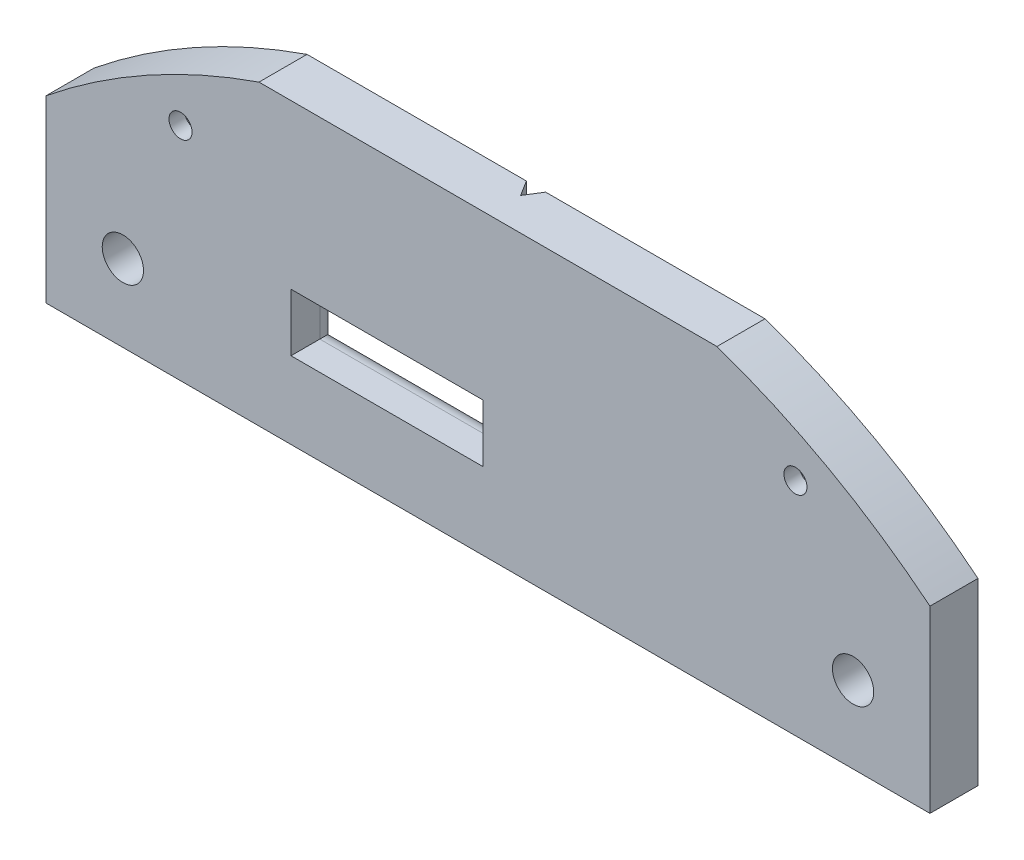
ISO-10303-21;
HEADER;
FILE_DESCRIPTION(('STEP AP214'),'2;1');
FILE_NAME('part.step','',(''),(''),'','','');
FILE_SCHEMA(('AUTOMOTIVE_DESIGN { 1 0 10303 214 1 1 1 1 }'));
ENDSEC;
DATA;
#1=APPLICATION_CONTEXT('core data for automotive mechanical design processes');
#2=APPLICATION_PROTOCOL_DEFINITION('international standard','automotive_design',2000,#1);
#3=PRODUCT_CONTEXT('',#1,'mechanical');
#4=PRODUCT('Part','Part','',(#3));
#5=PRODUCT_RELATED_PRODUCT_CATEGORY('part','',(#4));
#6=PRODUCT_DEFINITION_FORMATION('','',#4);
#7=PRODUCT_DEFINITION_CONTEXT('part definition',#1,'design');
#8=PRODUCT_DEFINITION('design','',#6,#7);
#9=PRODUCT_DEFINITION_SHAPE('','',#8);
#10=(LENGTH_UNIT() NAMED_UNIT(*) SI_UNIT(.MILLI.,.METRE.));
#11=(NAMED_UNIT(*) PLANE_ANGLE_UNIT() SI_UNIT($,.RADIAN.));
#12=(NAMED_UNIT(*) SI_UNIT($,.STERADIAN.) SOLID_ANGLE_UNIT());
#13=UNCERTAINTY_MEASURE_WITH_UNIT(LENGTH_MEASURE(1.E-05),#10,'distance_accuracy_value','');
#14=(GEOMETRIC_REPRESENTATION_CONTEXT(3) GLOBAL_UNCERTAINTY_ASSIGNED_CONTEXT((#13)) GLOBAL_UNIT_ASSIGNED_CONTEXT((#10,
#11,#12)) REPRESENTATION_CONTEXT('',''));
#15=CARTESIAN_POINT('',(0.,0.,0.));
#16=DIRECTION('',(0.,0.,1.));
#17=DIRECTION('',(1.,0.,0.));
#18=AXIS2_PLACEMENT_3D('',#15,#16,#17);
#19=CARTESIAN_POINT('',(32.,7.50000000000001,0.));
#20=DIRECTION('',(0.,0.,1.));
#21=DIRECTION('',(1.,0.,0.));
#22=AXIS2_PLACEMENT_3D('',#19,#20,#21);
#23=CYLINDRICAL_SURFACE('',#22,1.2);
#24=CARTESIAN_POINT('',(32.,7.50000000000001,5.));
#25=DIRECTION('',(0.,0.,1.));
#26=DIRECTION('',(1.,0.,0.));
#27=AXIS2_PLACEMENT_3D('',#24,#25,#26);
#28=CIRCLE('',#27,1.2);
#29=CARTESIAN_POINT('',(33.2,7.50000000000001,5.));
#30=VERTEX_POINT('',#29);
#31=EDGE_CURVE('E204',#30,#30,#28,.T.);
#32=ORIENTED_EDGE('',*,*,#31,.T.);
#33=EDGE_LOOP('',(#32));
#34=FACE_BOUND('',#33,.T.);
#35=CARTESIAN_POINT('',(32.,7.50000000000001,3.4));
#36=DIRECTION('',(0.,0.,-1.));
#37=DIRECTION('',(-1.,0.,0.));
#38=AXIS2_PLACEMENT_3D('',#35,#36,#37);
#39=CIRCLE('',#38,1.2);
#40=CARTESIAN_POINT('',(30.8,7.50000000000001,3.4));
#41=VERTEX_POINT('',#40);
#42=EDGE_CURVE('E201',#41,#41,#39,.F.);
#43=ORIENTED_EDGE('',*,*,#42,.F.);
#44=EDGE_LOOP('',(#43));
#45=FACE_BOUND('',#44,.T.);
#46=ADVANCED_FACE('F39',(#34,#45),#23,.F.);
#47=CARTESIAN_POINT('',(-32.,7.50000000000001,0.));
#48=DIRECTION('',(0.,0.,1.));
#49=DIRECTION('',(1.,0.,0.));
#50=AXIS2_PLACEMENT_3D('',#47,#48,#49);
#51=CYLINDRICAL_SURFACE('',#50,1.2);
#52=CARTESIAN_POINT('',(-32.,7.50000000000001,5.));
#53=DIRECTION('',(0.,0.,1.));
#54=DIRECTION('',(1.,0.,0.));
#55=AXIS2_PLACEMENT_3D('',#52,#53,#54);
#56=CIRCLE('',#55,1.2);
#57=CARTESIAN_POINT('',(-30.8,7.50000000000001,5.));
#58=VERTEX_POINT('',#57);
#59=EDGE_CURVE('E197',#58,#58,#56,.T.);
#60=ORIENTED_EDGE('',*,*,#59,.T.);
#61=EDGE_LOOP('',(#60));
#62=FACE_BOUND('',#61,.T.);
#63=CARTESIAN_POINT('',(-32.,7.50000000000001,3.4));
#64=DIRECTION('',(0.,0.,-1.));
#65=DIRECTION('',(-1.,0.,0.));
#66=AXIS2_PLACEMENT_3D('',#63,#64,#65);
#67=CIRCLE('',#66,1.2);
#68=CARTESIAN_POINT('',(-33.2,7.50000000000001,3.4));
#69=VERTEX_POINT('',#68);
#70=EDGE_CURVE('E186',#69,#69,#67,.F.);
#71=ORIENTED_EDGE('',*,*,#70,.F.);
#72=EDGE_LOOP('',(#71));
#73=FACE_BOUND('',#72,.T.);
#74=ADVANCED_FACE('F382',(#62,#73),#51,.F.);
#75=CARTESIAN_POINT('',(0.,0.,0.));
#76=DIRECTION('',(0.,0.,1.));
#77=DIRECTION('',(1.,0.,0.));
#78=AXIS2_PLACEMENT_3D('',#75,#76,#77);
#79=PLANE('',#78);
#80=CARTESIAN_POINT('',(-32.,7.50000000000001,0.));
#81=DIRECTION('',(0.,0.,-1.));
#82=DIRECTION('',(-1.,0.,0.));
#83=AXIS2_PLACEMENT_3D('',#80,#81,#82);
#84=CIRCLE('',#83,2.1);
#85=CARTESIAN_POINT('',(-34.1,7.50000000000001,0.));
#86=VERTEX_POINT('',#85);
#87=EDGE_CURVE('E188',#86,#86,#84,.T.);
#88=ORIENTED_EDGE('',*,*,#87,.F.);
#89=EDGE_LOOP('',(#88));
#90=FACE_BOUND('',#89,.T.);
#91=CARTESIAN_POINT('',(-38.,-7.49999999999999,0.));
#92=DIRECTION('',(0.,0.,1.));
#93=DIRECTION('',(-1.,0.,0.));
#94=AXIS2_PLACEMENT_3D('',#91,#92,#93);
#95=CIRCLE('',#94,2.15);
#96=CARTESIAN_POINT('',(-40.15,-7.49999999999999,0.));
#97=VERTEX_POINT('',#96);
#98=EDGE_CURVE('E223',#97,#97,#95,.T.);
#99=ORIENTED_EDGE('',*,*,#98,.T.);
#100=EDGE_LOOP('',(#99));
#101=FACE_BOUND('',#100,.T.);
#102=DIRECTION('',(0.,1.,0.));
#103=VECTOR('',#102,1.);
#104=CARTESIAN_POINT('',(-22.5,0.,0.));
#105=LINE('',#104,#103);
#106=CARTESIAN_POINT('',(-22.5,0.500000000000006,0.));
#107=VERTEX_POINT('',#106);
#108=CARTESIAN_POINT('',(-22.5,-9.49999999999999,0.));
#109=VERTEX_POINT('',#108);
#110=EDGE_CURVE('E295',#107,#109,#105,.F.);
#111=ORIENTED_EDGE('',*,*,#110,.T.);
#112=DIRECTION('',(-1.,0.,0.));
#113=VECTOR('',#112,1.);
#114=CARTESIAN_POINT('',(0.,-9.49999999999999,0.));
#115=LINE('',#114,#113);
#116=CARTESIAN_POINT('',(-1.,-9.5,0.));
#117=VERTEX_POINT('',#116);
#118=EDGE_CURVE('E298',#109,#117,#115,.F.);
#119=ORIENTED_EDGE('',*,*,#118,.T.);
#120=DIRECTION('',(0.,-1.,0.));
#121=VECTOR('',#120,1.);
#122=CARTESIAN_POINT('',(-1.,15.5,0.));
#123=LINE('',#122,#121);
#124=CARTESIAN_POINT('',(-1.,-15.5,0.));
#125=VERTEX_POINT('',#124);
#126=EDGE_CURVE('E224',#117,#125,#123,.T.);
#127=ORIENTED_EDGE('',*,*,#126,.T.);
#128=DIRECTION('',(1.,0.,0.));
#129=VECTOR('',#128,1.);
#130=CARTESIAN_POINT('',(-46.,-15.5,0.));
#131=LINE('',#130,#129);
#132=CARTESIAN_POINT('',(-46.,-15.5,0.));
#133=VERTEX_POINT('',#132);
#134=EDGE_CURVE('E256',#133,#125,#131,.T.);
#135=ORIENTED_EDGE('',*,*,#134,.F.);
#136=DIRECTION('',(0.,-1.,0.));
#137=VECTOR('',#136,1.);
#138=CARTESIAN_POINT('',(-46.,15.5,0.));
#139=LINE('',#138,#137);
#140=CARTESIAN_POINT('',(-46.,3.18333088307355,0.));
#141=VERTEX_POINT('',#140);
#142=EDGE_CURVE('E272',#141,#133,#139,.T.);
#143=ORIENTED_EDGE('',*,*,#142,.F.);
#144=CARTESIAN_POINT('',(0.,-53.5,0.));
#145=DIRECTION('',(0.,0.,1.));
#146=DIRECTION('',(1.,0.,0.));
#147=AXIS2_PLACEMENT_3D('',#144,#145,#146);
#148=CIRCLE('',#147,73.);
#149=CARTESIAN_POINT('',(-23.832750575626,15.5,0.));
#150=VERTEX_POINT('',#149);
#151=EDGE_CURVE('E283',#150,#141,#148,.T.);
#152=ORIENTED_EDGE('',*,*,#151,.F.);
#153=DIRECTION('',(-1.,0.,0.));
#154=VECTOR('',#153,1.);
#155=CARTESIAN_POINT('',(-46.,15.5,0.));
#156=LINE('',#155,#154);
#157=CARTESIAN_POINT('',(-1.,15.5,0.));
#158=VERTEX_POINT('',#157);
#159=EDGE_CURVE('E269',#158,#150,#156,.T.);
#160=ORIENTED_EDGE('',*,*,#159,.F.);
#161=CARTESIAN_POINT('',(-1.,0.500000000000006,0.));
#162=VERTEX_POINT('',#161);
#163=EDGE_CURVE('E217',#158,#162,#123,.T.);
#164=ORIENTED_EDGE('',*,*,#163,.T.);
#165=DIRECTION('',(1.,0.,0.));
#166=VECTOR('',#165,1.);
#167=CARTESIAN_POINT('',(0.,0.500000000000006,0.));
#168=LINE('',#167,#166);
#169=EDGE_CURVE('E292',#162,#107,#168,.F.);
#170=ORIENTED_EDGE('',*,*,#169,.T.);
#171=EDGE_LOOP('',(#111,#119,#127,#135,#143,#152,#160,#164,#170));
#172=FACE_BOUND('',#171,.T.);
#173=ADVANCED_FACE('F328',(#90,#101,#172),#79,.F.);
#174=CARTESIAN_POINT('',(46.,15.5,5.));
#175=DIRECTION('',(-1.,0.,0.));
#176=DIRECTION('',(0.,0.,1.));
#177=AXIS2_PLACEMENT_3D('',#174,#175,#176);
#178=PLANE('',#177);
#179=DIRECTION('',(0.,0.,1.));
#180=VECTOR('',#179,1.);
#181=CARTESIAN_POINT('',(46.,3.18333088307357,0.));
#182=LINE('',#181,#180);
#183=CARTESIAN_POINT('',(46.,3.18333088307357,5.));
#184=VERTEX_POINT('',#183);
#185=CARTESIAN_POINT('',(46.,3.18333088307357,0.));
#186=VERTEX_POINT('',#185);
#187=EDGE_CURVE('E249',#184,#186,#182,.F.);
#188=ORIENTED_EDGE('',*,*,#187,.F.);
#189=DIRECTION('',(0.,1.,0.));
#190=VECTOR('',#189,1.);
#191=CARTESIAN_POINT('',(46.,15.5,5.));
#192=LINE('',#191,#190);
#193=CARTESIAN_POINT('',(46.,-15.5,5.));
#194=VERTEX_POINT('',#193);
#195=EDGE_CURVE('E254',#194,#184,#192,.T.);
#196=ORIENTED_EDGE('',*,*,#195,.F.);
#197=DIRECTION('',(0.,0.,-1.));
#198=VECTOR('',#197,1.);
#199=CARTESIAN_POINT('',(46.,-15.5,5.));
#200=LINE('',#199,#198);
#201=CARTESIAN_POINT('',(46.,-15.5,0.));
#202=VERTEX_POINT('',#201);
#203=EDGE_CURVE('E265',#194,#202,#200,.T.);
#204=ORIENTED_EDGE('',*,*,#203,.T.);
#205=DIRECTION('',(0.,1.,0.));
#206=VECTOR('',#205,1.);
#207=CARTESIAN_POINT('',(46.,15.5,0.));
#208=LINE('',#207,#206);
#209=EDGE_CURVE('E255',#202,#186,#208,.T.);
#210=ORIENTED_EDGE('',*,*,#209,.T.);
#211=EDGE_LOOP('',(#188,#196,#204,#210));
#212=FACE_BOUND('',#211,.T.);
#213=ADVANCED_FACE('F370',(#212),#178,.F.);
#214=CARTESIAN_POINT('',(-46.,15.5,5.));
#215=DIRECTION('',(0.,-1.,0.));
#216=DIRECTION('',(0.,0.,-1.));
#217=AXIS2_PLACEMENT_3D('',#214,#215,#216);
#218=PLANE('',#217);
#219=DIRECTION('',(-0.52999894000318,0.,0.847998304005088));
#220=VECTOR('',#219,1.);
#221=CARTESIAN_POINT('',(0.,15.5,1.6));
#222=LINE('',#221,#220);
#223=CARTESIAN_POINT('',(1.,15.5,0.));
#224=VERTEX_POINT('',#223);
#225=CARTESIAN_POINT('',(0.,15.5,1.6));
#226=VERTEX_POINT('',#225);
#227=EDGE_CURVE('E207',#224,#226,#222,.T.);
#228=ORIENTED_EDGE('',*,*,#227,.T.);
#229=DIRECTION('',(-0.52999894000318,0.,-0.847998304005088));
#230=VECTOR('',#229,1.);
#231=CARTESIAN_POINT('',(-1.,15.5,0.));
#232=LINE('',#231,#230);
#233=EDGE_CURVE('E209',#226,#158,#232,.T.);
#234=ORIENTED_EDGE('',*,*,#233,.T.);
#235=ORIENTED_EDGE('',*,*,#159,.T.);
#236=DIRECTION('',(0.,0.,1.));
#237=VECTOR('',#236,1.);
#238=CARTESIAN_POINT('',(-23.832750575626,15.5,0.));
#239=LINE('',#238,#237);
#240=CARTESIAN_POINT('',(-23.832750575626,15.5,5.));
#241=VERTEX_POINT('',#240);
#242=EDGE_CURVE('E244',#241,#150,#239,.F.);
#243=ORIENTED_EDGE('',*,*,#242,.F.);
#244=DIRECTION('',(-1.,0.,0.));
#245=VECTOR('',#244,1.);
#246=CARTESIAN_POINT('',(-46.,15.5,5.));
#247=LINE('',#246,#245);
#248=CARTESIAN_POINT('',(23.832750575626,15.5,5.));
#249=VERTEX_POINT('',#248);
#250=EDGE_CURVE('E259',#249,#241,#247,.T.);
#251=ORIENTED_EDGE('',*,*,#250,.F.);
#252=DIRECTION('',(0.,0.,1.));
#253=VECTOR('',#252,1.);
#254=CARTESIAN_POINT('',(23.832750575626,15.5,0.));
#255=LINE('',#254,#253);
#256=CARTESIAN_POINT('',(23.832750575626,15.5,0.));
#257=VERTEX_POINT('',#256);
#258=EDGE_CURVE('E247',#257,#249,#255,.T.);
#259=ORIENTED_EDGE('',*,*,#258,.F.);
#260=EDGE_CURVE('E267',#257,#224,#156,.T.);
#261=ORIENTED_EDGE('',*,*,#260,.T.);
#262=EDGE_LOOP('',(#228,#234,#235,#243,#251,#259,#261));
#263=FACE_BOUND('',#262,.T.);
#264=ADVANCED_FACE('F331',(#263),#218,.F.);
#265=CARTESIAN_POINT('',(-46.,15.5,5.));
#266=DIRECTION('',(1.,0.,0.));
#267=DIRECTION('',(0.,0.,-1.));
#268=AXIS2_PLACEMENT_3D('',#265,#266,#267);
#269=PLANE('',#268);
#270=DIRECTION('',(0.,0.,1.));
#271=VECTOR('',#270,1.);
#272=CARTESIAN_POINT('',(-46.,3.18333088307355,0.));
#273=LINE('',#272,#271);
#274=CARTESIAN_POINT('',(-46.,3.18333088307355,5.));
#275=VERTEX_POINT('',#274);
#276=EDGE_CURVE('E239',#141,#275,#273,.T.);
#277=ORIENTED_EDGE('',*,*,#276,.F.);
#278=ORIENTED_EDGE('',*,*,#142,.T.);
#279=DIRECTION('',(0.,0.,-1.));
#280=VECTOR('',#279,1.);
#281=CARTESIAN_POINT('',(-46.,-15.5,5.));
#282=LINE('',#281,#280);
#283=CARTESIAN_POINT('',(-46.,-15.5,5.));
#284=VERTEX_POINT('',#283);
#285=EDGE_CURVE('E280',#284,#133,#282,.T.);
#286=ORIENTED_EDGE('',*,*,#285,.F.);
#287=DIRECTION('',(0.,-1.,0.));
#288=VECTOR('',#287,1.);
#289=CARTESIAN_POINT('',(-46.,15.5,5.));
#290=LINE('',#289,#288);
#291=EDGE_CURVE('E257',#275,#284,#290,.T.);
#292=ORIENTED_EDGE('',*,*,#291,.F.);
#293=EDGE_LOOP('',(#277,#278,#286,#292));
#294=FACE_BOUND('',#293,.T.);
#295=ADVANCED_FACE('F343',(#294),#269,.F.);
#296=CARTESIAN_POINT('',(0.,0.,5.));
#297=DIRECTION('',(0.,0.,1.));
#298=DIRECTION('',(1.,0.,0.));
#299=AXIS2_PLACEMENT_3D('',#296,#297,#298);
#300=PLANE('',#299);
#301=DIRECTION('',(0.,1.,0.));
#302=VECTOR('',#301,1.);
#303=CARTESIAN_POINT('',(-20.5,-1.49999999999999,5.));
#304=LINE('',#303,#302);
#305=CARTESIAN_POINT('',(-20.5,-7.49999999999999,5.));
#306=VERTEX_POINT('',#305);
#307=CARTESIAN_POINT('',(-20.5,-1.49999999999999,5.));
#308=VERTEX_POINT('',#307);
#309=EDGE_CURVE('E157',#306,#308,#304,.T.);
#310=ORIENTED_EDGE('',*,*,#309,.T.);
#311=DIRECTION('',(1.,0.,0.));
#312=VECTOR('',#311,1.);
#313=CARTESIAN_POINT('',(-0.500000000000019,-1.49999999999999,5.));
#314=LINE('',#313,#312);
#315=CARTESIAN_POINT('',(-0.500000000000019,-1.49999999999999,5.));
#316=VERTEX_POINT('',#315);
#317=EDGE_CURVE('E165',#308,#316,#314,.T.);
#318=ORIENTED_EDGE('',*,*,#317,.T.);
#319=DIRECTION('',(0.,-1.,0.));
#320=VECTOR('',#319,1.);
#321=CARTESIAN_POINT('',(-0.500000000000019,-1.49999999999999,5.));
#322=LINE('',#321,#320);
#323=CARTESIAN_POINT('',(-0.50000000000002,-7.49999999999999,5.));
#324=VERTEX_POINT('',#323);
#325=EDGE_CURVE('E166',#316,#324,#322,.T.);
#326=ORIENTED_EDGE('',*,*,#325,.T.);
#327=DIRECTION('',(-1.,0.,0.));
#328=VECTOR('',#327,1.);
#329=CARTESIAN_POINT('',(-0.50000000000002,-7.49999999999999,5.));
#330=LINE('',#329,#328);
#331=EDGE_CURVE('E163',#324,#306,#330,.T.);
#332=ORIENTED_EDGE('',*,*,#331,.T.);
#333=EDGE_LOOP('',(#310,#318,#326,#332));
#334=FACE_BOUND('',#333,.T.);
#335=ORIENTED_EDGE('',*,*,#59,.F.);
#336=EDGE_LOOP('',(#335));
#337=FACE_BOUND('',#336,.T.);
#338=ORIENTED_EDGE('',*,*,#31,.F.);
#339=EDGE_LOOP('',(#338));
#340=FACE_BOUND('',#339,.T.);
#341=CARTESIAN_POINT('',(38.,-7.49999999999999,5.));
#342=DIRECTION('',(0.,0.,1.));
#343=DIRECTION('',(1.,0.,0.));
#344=AXIS2_PLACEMENT_3D('',#341,#342,#343);
#345=CIRCLE('',#344,2.15);
#346=CARTESIAN_POINT('',(40.15,-7.49999999999999,5.));
#347=VERTEX_POINT('',#346);
#348=EDGE_CURVE('E229',#347,#347,#345,.T.);
#349=ORIENTED_EDGE('',*,*,#348,.F.);
#350=EDGE_LOOP('',(#349));
#351=FACE_BOUND('',#350,.T.);
#352=CARTESIAN_POINT('',(-38.,-7.49999999999999,5.));
#353=DIRECTION('',(0.,0.,1.));
#354=DIRECTION('',(-1.,0.,0.));
#355=AXIS2_PLACEMENT_3D('',#352,#353,#354);
#356=CIRCLE('',#355,2.15);
#357=CARTESIAN_POINT('',(-40.15,-7.49999999999999,5.));
#358=VERTEX_POINT('',#357);
#359=EDGE_CURVE('E231',#358,#358,#356,.T.);
#360=ORIENTED_EDGE('',*,*,#359,.F.);
#361=EDGE_LOOP('',(#360));
#362=FACE_BOUND('',#361,.T.);
#363=ORIENTED_EDGE('',*,*,#195,.T.);
#364=CARTESIAN_POINT('',(0.,-53.5,5.));
#365=DIRECTION('',(0.,0.,1.));
#366=DIRECTION('',(1.,0.,0.));
#367=AXIS2_PLACEMENT_3D('',#364,#365,#366);
#368=CIRCLE('',#367,73.);
#369=EDGE_CURVE('E241',#184,#249,#368,.T.);
#370=ORIENTED_EDGE('',*,*,#369,.T.);
#371=ORIENTED_EDGE('',*,*,#250,.T.);
#372=EDGE_CURVE('E230',#241,#275,#368,.T.);
#373=ORIENTED_EDGE('',*,*,#372,.T.);
#374=ORIENTED_EDGE('',*,*,#291,.T.);
#375=DIRECTION('',(1.,0.,0.));
#376=VECTOR('',#375,1.);
#377=CARTESIAN_POINT('',(-46.,-15.5,5.));
#378=LINE('',#377,#376);
#379=EDGE_CURVE('E264',#284,#194,#378,.T.);
#380=ORIENTED_EDGE('',*,*,#379,.T.);
#381=EDGE_LOOP('',(#363,#370,#371,#373,#374,#380));
#382=FACE_BOUND('',#381,.T.);
#383=ADVANCED_FACE('F167',(#334,#337,#340,#351,#362,#382),#300,.T.);
#384=CARTESIAN_POINT('',(32.,7.50000000000001,0.));
#385=DIRECTION('',(0.,0.,-1.));
#386=DIRECTION('',(-1.,0.,0.));
#387=AXIS2_PLACEMENT_3D('',#384,#385,#386);
#388=CIRCLE('',#387,2.1);
#389=CARTESIAN_POINT('',(29.9,7.50000000000001,0.));
#390=VERTEX_POINT('',#389);
#391=EDGE_CURVE('E195',#390,#390,#388,.T.);
#392=ORIENTED_EDGE('',*,*,#391,.F.);
#393=EDGE_LOOP('',(#392));
#394=FACE_BOUND('',#393,.T.);
#395=CARTESIAN_POINT('',(38.,-7.49999999999999,0.));
#396=DIRECTION('',(0.,0.,1.));
#397=DIRECTION('',(1.,0.,0.));
#398=AXIS2_PLACEMENT_3D('',#395,#396,#397);
#399=CIRCLE('',#398,2.15);
#400=CARTESIAN_POINT('',(40.15,-7.49999999999999,0.));
#401=VERTEX_POINT('',#400);
#402=EDGE_CURVE('E228',#401,#401,#399,.T.);
#403=ORIENTED_EDGE('',*,*,#402,.T.);
#404=EDGE_LOOP('',(#403));
#405=FACE_BOUND('',#404,.T.);
#406=CARTESIAN_POINT('',(1.,-15.5,0.));
#407=VERTEX_POINT('',#406);
#408=EDGE_CURVE('E271',#407,#202,#131,.T.);
#409=ORIENTED_EDGE('',*,*,#408,.F.);
#410=DIRECTION('',(0.,-1.,0.));
#411=VECTOR('',#410,1.);
#412=CARTESIAN_POINT('',(1.,15.5,0.));
#413=LINE('',#412,#411);
#414=EDGE_CURVE('E215',#224,#407,#413,.T.);
#415=ORIENTED_EDGE('',*,*,#414,.F.);
#416=ORIENTED_EDGE('',*,*,#260,.F.);
#417=CARTESIAN_POINT('',(0.,-53.5,0.));
#418=DIRECTION('',(0.,0.,1.));
#419=DIRECTION('',(1.,0.,0.));
#420=AXIS2_PLACEMENT_3D('',#417,#418,#419);
#421=CIRCLE('',#420,73.);
#422=EDGE_CURVE('E238',#186,#257,#421,.T.);
#423=ORIENTED_EDGE('',*,*,#422,.F.);
#424=ORIENTED_EDGE('',*,*,#209,.F.);
#425=EDGE_LOOP('',(#409,#415,#416,#423,#424));
#426=FACE_BOUND('',#425,.T.);
#427=ADVANCED_FACE('F357',(#394,#405,#426),#79,.F.);
#428=CARTESIAN_POINT('',(-46.,-15.5,5.));
#429=DIRECTION('',(0.,1.,0.));
#430=DIRECTION('',(0.,0.,1.));
#431=AXIS2_PLACEMENT_3D('',#428,#429,#430);
#432=PLANE('',#431);
#433=ORIENTED_EDGE('',*,*,#134,.T.);
#434=DIRECTION('',(-0.52999894000318,0.,-0.847998304005088));
#435=VECTOR('',#434,1.);
#436=CARTESIAN_POINT('',(-1.,-15.5,0.));
#437=LINE('',#436,#435);
#438=CARTESIAN_POINT('',(0.,-15.5,1.6));
#439=VERTEX_POINT('',#438);
#440=EDGE_CURVE('E208',#439,#125,#437,.T.);
#441=ORIENTED_EDGE('',*,*,#440,.F.);
#442=DIRECTION('',(-0.52999894000318,0.,0.847998304005088));
#443=VECTOR('',#442,1.);
#444=CARTESIAN_POINT('',(0.,-15.5,1.6));
#445=LINE('',#444,#443);
#446=EDGE_CURVE('E203',#407,#439,#445,.T.);
#447=ORIENTED_EDGE('',*,*,#446,.F.);
#448=ORIENTED_EDGE('',*,*,#408,.T.);
#449=ORIENTED_EDGE('',*,*,#203,.F.);
#450=ORIENTED_EDGE('',*,*,#379,.F.);
#451=ORIENTED_EDGE('',*,*,#285,.T.);
#452=EDGE_LOOP('',(#433,#441,#447,#448,#449,#450,#451));
#453=FACE_BOUND('',#452,.T.);
#454=ADVANCED_FACE('F361',(#453),#432,.F.);
#455=CARTESIAN_POINT('',(0.,-53.5,0.));
#456=DIRECTION('',(0.,0.,1.));
#457=DIRECTION('',(1.,0.,0.));
#458=AXIS2_PLACEMENT_3D('',#455,#456,#457);
#459=CYLINDRICAL_SURFACE('',#458,73.);
#460=ORIENTED_EDGE('',*,*,#242,.T.);
#461=ORIENTED_EDGE('',*,*,#151,.T.);
#462=ORIENTED_EDGE('',*,*,#276,.T.);
#463=ORIENTED_EDGE('',*,*,#372,.F.);
#464=EDGE_LOOP('',(#460,#461,#462,#463));
#465=FACE_BOUND('',#464,.T.);
#466=ADVANCED_FACE('F338',(#465),#459,.T.);
#467=ORIENTED_EDGE('',*,*,#187,.T.);
#468=ORIENTED_EDGE('',*,*,#422,.T.);
#469=ORIENTED_EDGE('',*,*,#258,.T.);
#470=ORIENTED_EDGE('',*,*,#369,.F.);
#471=EDGE_LOOP('',(#467,#468,#469,#470));
#472=FACE_BOUND('',#471,.T.);
#473=ADVANCED_FACE('F368',(#472),#459,.T.);
#474=CARTESIAN_POINT('',(-38.,-7.49999999999999,0.));
#475=DIRECTION('',(0.,0.,1.));
#476=DIRECTION('',(1.,0.,0.));
#477=AXIS2_PLACEMENT_3D('',#474,#475,#476);
#478=CYLINDRICAL_SURFACE('',#477,2.15);
#479=ORIENTED_EDGE('',*,*,#98,.F.);
#480=EDGE_LOOP('',(#479));
#481=FACE_BOUND('',#480,.T.);
#482=ORIENTED_EDGE('',*,*,#359,.T.);
#483=EDGE_LOOP('',(#482));
#484=FACE_BOUND('',#483,.T.);
#485=ADVANCED_FACE('F369',(#481,#484),#478,.F.);
#486=CARTESIAN_POINT('',(38.,-7.49999999999999,0.));
#487=DIRECTION('',(0.,0.,1.));
#488=DIRECTION('',(1.,0.,0.));
#489=AXIS2_PLACEMENT_3D('',#486,#487,#488);
#490=CYLINDRICAL_SURFACE('',#489,2.15);
#491=ORIENTED_EDGE('',*,*,#402,.F.);
#492=EDGE_LOOP('',(#491));
#493=FACE_BOUND('',#492,.T.);
#494=ORIENTED_EDGE('',*,*,#348,.T.);
#495=EDGE_LOOP('',(#494));
#496=FACE_BOUND('',#495,.T.);
#497=ADVANCED_FACE('F376',(#493,#496),#490,.F.);
#498=CARTESIAN_POINT('',(-1.,15.5,0.));
#499=DIRECTION('',(-0.847998304005088,0.,0.52999894000318));
#500=DIRECTION('',(0.52999894000318,0.,0.847998304005088));
#501=AXIS2_PLACEMENT_3D('',#498,#499,#500);
#502=PLANE('',#501);
#503=CARTESIAN_POINT('',(0.249999999999999,-9.49999999999999,2.));
#504=DIRECTION('',(-0.847998304005088,0.,0.52999894000318));
#505=DIRECTION('',(-0.52999894000318,0.,-0.847998304005088));
#506=AXIS2_PLACEMENT_3D('',#503,#504,#505);
#507=ELLIPSE('',#506,2.35849528301415,2.);
#508=CARTESIAN_POINT('',(-0.50000000000002,-7.89999999999975,0.799999999999971));
#509=VERTEX_POINT('',#508);
#510=EDGE_CURVE('E297',#117,#509,#507,.F.);
#511=ORIENTED_EDGE('',*,*,#510,.T.);
#512=DIRECTION('',(0.,1.,0.));
#513=VECTOR('',#512,1.);
#514=CARTESIAN_POINT('',(-0.500000000000017,15.5,0.799999999999975));
#515=LINE('',#514,#513);
#516=CARTESIAN_POINT('',(-0.500000000000019,-1.10000000000024,0.799999999999973));
#517=VERTEX_POINT('',#516);
#518=EDGE_CURVE('E282',#509,#517,#515,.T.);
#519=ORIENTED_EDGE('',*,*,#518,.T.);
#520=CARTESIAN_POINT('',(0.249999999999999,0.500000000000006,2.));
#521=DIRECTION('',(-0.847998304005088,0.,0.52999894000318));
#522=DIRECTION('',(0.52999894000318,0.,0.847998304005088));
#523=AXIS2_PLACEMENT_3D('',#520,#521,#522);
#524=ELLIPSE('',#523,2.35849528301415,2.);
#525=EDGE_CURVE('E296',#517,#162,#524,.F.);
#526=ORIENTED_EDGE('',*,*,#525,.T.);
#527=ORIENTED_EDGE('',*,*,#163,.F.);
#528=ORIENTED_EDGE('',*,*,#233,.F.);
#529=DIRECTION('',(0.,-1.,0.));
#530=VECTOR('',#529,1.);
#531=CARTESIAN_POINT('',(0.,15.5,1.6));
#532=LINE('',#531,#530);
#533=EDGE_CURVE('E222',#226,#439,#532,.T.);
#534=ORIENTED_EDGE('',*,*,#533,.T.);
#535=ORIENTED_EDGE('',*,*,#440,.T.);
#536=ORIENTED_EDGE('',*,*,#126,.F.);
#537=EDGE_LOOP('',(#511,#519,#526,#527,#528,#534,#535,#536));
#538=FACE_BOUND('',#537,.T.);
#539=ADVANCED_FACE('F321',(#538),#502,.F.);
#540=CARTESIAN_POINT('',(0.,15.5,1.6));
#541=DIRECTION('',(0.847998304005088,0.,0.52999894000318));
#542=DIRECTION('',(0.52999894000318,0.,-0.847998304005088));
#543=AXIS2_PLACEMENT_3D('',#540,#541,#542);
#544=PLANE('',#543);
#545=ORIENTED_EDGE('',*,*,#446,.T.);
#546=ORIENTED_EDGE('',*,*,#533,.F.);
#547=ORIENTED_EDGE('',*,*,#227,.F.);
#548=ORIENTED_EDGE('',*,*,#414,.T.);
#549=EDGE_LOOP('',(#545,#546,#547,#548));
#550=FACE_BOUND('',#549,.T.);
#551=ADVANCED_FACE('F363',(#550),#544,.F.);
#552=CARTESIAN_POINT('',(-32.,7.50000000000001,3.4));
#553=DIRECTION('',(0.,0.,-1.));
#554=DIRECTION('',(-1.,0.,0.));
#555=AXIS2_PLACEMENT_3D('',#552,#553,#554);
#556=PLANE('',#555);
#557=CARTESIAN_POINT('',(-32.,7.50000000000001,3.4));
#558=DIRECTION('',(0.,0.,-1.));
#559=DIRECTION('',(-1.,0.,0.));
#560=AXIS2_PLACEMENT_3D('',#557,#558,#559);
#561=CIRCLE('',#560,2.1);
#562=CARTESIAN_POINT('',(-34.1,7.50000000000001,3.4));
#563=VERTEX_POINT('',#562);
#564=EDGE_CURVE('E187',#563,#563,#561,.T.);
#565=ORIENTED_EDGE('',*,*,#564,.T.);
#566=EDGE_LOOP('',(#565));
#567=FACE_BOUND('',#566,.T.);
#568=ORIENTED_EDGE('',*,*,#70,.T.);
#569=EDGE_LOOP('',(#568));
#570=FACE_BOUND('',#569,.T.);
#571=ADVANCED_FACE('F398',(#567,#570),#556,.T.);
#572=CARTESIAN_POINT('',(-32.,7.50000000000001,3.4));
#573=DIRECTION('',(0.,0.,-1.));
#574=DIRECTION('',(-1.,0.,0.));
#575=AXIS2_PLACEMENT_3D('',#572,#573,#574);
#576=CYLINDRICAL_SURFACE('',#575,2.1);
#577=ORIENTED_EDGE('',*,*,#564,.F.);
#578=EDGE_LOOP('',(#577));
#579=FACE_BOUND('',#578,.T.);
#580=ORIENTED_EDGE('',*,*,#87,.T.);
#581=EDGE_LOOP('',(#580));
#582=FACE_BOUND('',#581,.T.);
#583=ADVANCED_FACE('F445',(#579,#582),#576,.F.);
#584=CARTESIAN_POINT('',(32.,7.50000000000001,3.4));
#585=DIRECTION('',(0.,0.,-1.));
#586=DIRECTION('',(-1.,0.,0.));
#587=AXIS2_PLACEMENT_3D('',#584,#585,#586);
#588=PLANE('',#587);
#589=CARTESIAN_POINT('',(32.,7.50000000000001,3.4));
#590=DIRECTION('',(0.,0.,-1.));
#591=DIRECTION('',(-1.,0.,0.));
#592=AXIS2_PLACEMENT_3D('',#589,#590,#591);
#593=CIRCLE('',#592,2.1);
#594=CARTESIAN_POINT('',(29.9,7.50000000000001,3.4));
#595=VERTEX_POINT('',#594);
#596=EDGE_CURVE('E181',#595,#595,#593,.T.);
#597=ORIENTED_EDGE('',*,*,#596,.T.);
#598=EDGE_LOOP('',(#597));
#599=FACE_BOUND('',#598,.T.);
#600=ORIENTED_EDGE('',*,*,#42,.T.);
#601=EDGE_LOOP('',(#600));
#602=FACE_BOUND('',#601,.T.);
#603=ADVANCED_FACE('F447',(#599,#602),#588,.T.);
#604=CARTESIAN_POINT('',(32.,7.50000000000001,3.4));
#605=DIRECTION('',(0.,0.,-1.));
#606=DIRECTION('',(-1.,0.,0.));
#607=AXIS2_PLACEMENT_3D('',#604,#605,#606);
#608=CYLINDRICAL_SURFACE('',#607,2.1);
#609=ORIENTED_EDGE('',*,*,#596,.F.);
#610=EDGE_LOOP('',(#609));
#611=FACE_BOUND('',#610,.T.);
#612=ORIENTED_EDGE('',*,*,#391,.T.);
#613=EDGE_LOOP('',(#612));
#614=FACE_BOUND('',#613,.T.);
#615=ADVANCED_FACE('F449',(#611,#614),#608,.F.);
#616=CARTESIAN_POINT('',(-0.50000000000002,-7.49999999999999,5.));
#617=DIRECTION('',(0.,-1.,0.));
#618=DIRECTION('',(0.,0.,-1.));
#619=AXIS2_PLACEMENT_3D('',#616,#617,#618);
#620=PLANE('',#619);
#621=DIRECTION('',(0.,0.,-1.));
#622=VECTOR('',#621,1.);
#623=CARTESIAN_POINT('',(-0.50000000000002,-7.49999999999999,5.));
#624=LINE('',#623,#622);
#625=CARTESIAN_POINT('',(-0.50000000000002,-7.49999999999999,2.));
#626=VERTEX_POINT('',#625);
#627=EDGE_CURVE('E185',#324,#626,#624,.T.);
#628=ORIENTED_EDGE('',*,*,#627,.T.);
#629=DIRECTION('',(-1.,0.,0.));
#630=VECTOR('',#629,1.);
#631=CARTESIAN_POINT('',(-0.50000000000002,-7.49999999999999,2.));
#632=LINE('',#631,#630);
#633=CARTESIAN_POINT('',(-20.5,-7.49999999999999,2.));
#634=VERTEX_POINT('',#633);
#635=EDGE_CURVE('E290',#626,#634,#632,.T.);
#636=ORIENTED_EDGE('',*,*,#635,.T.);
#637=DIRECTION('',(0.,0.,-1.));
#638=VECTOR('',#637,1.);
#639=CARTESIAN_POINT('',(-20.5,-7.49999999999999,5.));
#640=LINE('',#639,#638);
#641=EDGE_CURVE('E177',#306,#634,#640,.T.);
#642=ORIENTED_EDGE('',*,*,#641,.F.);
#643=ORIENTED_EDGE('',*,*,#331,.F.);
#644=EDGE_LOOP('',(#628,#636,#642,#643));
#645=FACE_BOUND('',#644,.T.);
#646=ADVANCED_FACE('F320',(#645),#620,.F.);
#647=CARTESIAN_POINT('',(-0.500000000000019,-1.49999999999999,5.));
#648=DIRECTION('',(1.,0.,0.));
#649=DIRECTION('',(0.,1.,0.));
#650=AXIS2_PLACEMENT_3D('',#647,#648,#649);
#651=PLANE('',#650);
#652=ORIENTED_EDGE('',*,*,#627,.F.);
#653=ORIENTED_EDGE('',*,*,#325,.F.);
#654=DIRECTION('',(0.,0.,-1.));
#655=VECTOR('',#654,1.);
#656=CARTESIAN_POINT('',(-0.500000000000019,-1.49999999999999,5.));
#657=LINE('',#656,#655);
#658=CARTESIAN_POINT('',(-0.500000000000019,-1.49999999999999,2.));
#659=VERTEX_POINT('',#658);
#660=EDGE_CURVE('E156',#316,#659,#657,.T.);
#661=ORIENTED_EDGE('',*,*,#660,.T.);
#662=CARTESIAN_POINT('',(-0.500000000000019,0.500000000000006,2.));
#663=DIRECTION('',(1.,0.,0.));
#664=DIRECTION('',(0.,1.,0.));
#665=AXIS2_PLACEMENT_3D('',#662,#663,#664);
#666=CIRCLE('',#665,2.);
#667=EDGE_CURVE('E11',#659,#517,#666,.T.);
#668=ORIENTED_EDGE('',*,*,#667,.T.);
#669=ORIENTED_EDGE('',*,*,#518,.F.);
#670=CARTESIAN_POINT('',(-0.50000000000002,-9.49999999999999,2.));
#671=DIRECTION('',(1.,0.,0.));
#672=DIRECTION('',(0.,1.,0.));
#673=AXIS2_PLACEMENT_3D('',#670,#671,#672);
#674=CIRCLE('',#673,2.);
#675=EDGE_CURVE('E48',#509,#626,#674,.T.);
#676=ORIENTED_EDGE('',*,*,#675,.T.);
#677=EDGE_LOOP('',(#652,#653,#661,#668,#669,#676));
#678=FACE_BOUND('',#677,.T.);
#679=ADVANCED_FACE('F316',(#678),#651,.F.);
#680=CARTESIAN_POINT('',(-0.500000000000019,-1.49999999999999,5.));
#681=DIRECTION('',(0.,1.,0.));
#682=DIRECTION('',(-1.,0.,0.));
#683=AXIS2_PLACEMENT_3D('',#680,#681,#682);
#684=PLANE('',#683);
#685=DIRECTION('',(0.,0.,-1.));
#686=VECTOR('',#685,1.);
#687=CARTESIAN_POINT('',(-20.5,-1.49999999999999,5.));
#688=LINE('',#687,#686);
#689=CARTESIAN_POINT('',(-20.5,-1.49999999999999,2.));
#690=VERTEX_POINT('',#689);
#691=EDGE_CURVE('E155',#308,#690,#688,.T.);
#692=ORIENTED_EDGE('',*,*,#691,.T.);
#693=DIRECTION('',(1.,0.,0.));
#694=VECTOR('',#693,1.);
#695=CARTESIAN_POINT('',(-0.500000000000019,-1.49999999999999,2.));
#696=LINE('',#695,#694);
#697=EDGE_CURVE('E57',#690,#659,#696,.T.);
#698=ORIENTED_EDGE('',*,*,#697,.T.);
#699=ORIENTED_EDGE('',*,*,#660,.F.);
#700=ORIENTED_EDGE('',*,*,#317,.F.);
#701=EDGE_LOOP('',(#692,#698,#699,#700));
#702=FACE_BOUND('',#701,.T.);
#703=ADVANCED_FACE('F164',(#702),#684,.F.);
#704=CARTESIAN_POINT('',(-20.5,-1.49999999999999,5.));
#705=DIRECTION('',(-1.,0.,0.));
#706=DIRECTION('',(0.,0.,1.));
#707=AXIS2_PLACEMENT_3D('',#704,#705,#706);
#708=PLANE('',#707);
#709=ORIENTED_EDGE('',*,*,#641,.T.);
#710=DIRECTION('',(0.,1.,0.));
#711=VECTOR('',#710,1.);
#712=CARTESIAN_POINT('',(-20.5,-1.49999999999999,2.));
#713=LINE('',#712,#711);
#714=EDGE_CURVE('E63',#634,#690,#713,.T.);
#715=ORIENTED_EDGE('',*,*,#714,.T.);
#716=ORIENTED_EDGE('',*,*,#691,.F.);
#717=ORIENTED_EDGE('',*,*,#309,.F.);
#718=EDGE_LOOP('',(#709,#715,#716,#717));
#719=FACE_BOUND('',#718,.T.);
#720=ADVANCED_FACE('F158',(#719),#708,.F.);
#721=CARTESIAN_POINT('',(-0.500000000000019,0.500000000000006,2.));
#722=DIRECTION('',(1.,0.,0.));
#723=DIRECTION('',(0.,1.,0.));
#724=AXIS2_PLACEMENT_3D('',#721,#722,#723);
#725=CYLINDRICAL_SURFACE('',#724,2.);
#726=ORIENTED_EDGE('',*,*,#667,.F.);
#727=ORIENTED_EDGE('',*,*,#697,.F.);
#728=CARTESIAN_POINT('',(-22.5,0.500000000000006,2.));
#729=DIRECTION('',(0.707106781186547,0.707106781186547,0.));
#730=DIRECTION('',(-0.707106781186547,0.707106781186547,0.));
#731=AXIS2_PLACEMENT_3D('',#728,#729,#730);
#732=ELLIPSE('',#731,2.82842712474619,2.);
#733=EDGE_CURVE('E43',#107,#690,#732,.F.);
#734=ORIENTED_EDGE('',*,*,#733,.F.);
#735=ORIENTED_EDGE('',*,*,#169,.F.);
#736=ORIENTED_EDGE('',*,*,#525,.F.);
#737=EDGE_LOOP('',(#726,#727,#734,#735,#736));
#738=FACE_BOUND('',#737,.T.);
#739=ADVANCED_FACE('F41',(#738),#725,.T.);
#740=CARTESIAN_POINT('',(-22.5,-1.49999999999999,2.));
#741=DIRECTION('',(0.,1.,0.));
#742=DIRECTION('',(0.,0.,1.));
#743=AXIS2_PLACEMENT_3D('',#740,#741,#742);
#744=CYLINDRICAL_SURFACE('',#743,2.);
#745=ORIENTED_EDGE('',*,*,#733,.T.);
#746=ORIENTED_EDGE('',*,*,#714,.F.);
#747=CARTESIAN_POINT('',(-22.5,-9.49999999999999,2.));
#748=DIRECTION('',(-0.707106781186547,0.707106781186547,0.));
#749=DIRECTION('',(-0.707106781186547,-0.707106781186547,0.));
#750=AXIS2_PLACEMENT_3D('',#747,#748,#749);
#751=ELLIPSE('',#750,2.82842712474619,2.);
#752=EDGE_CURVE('E174',#109,#634,#751,.F.);
#753=ORIENTED_EDGE('',*,*,#752,.F.);
#754=ORIENTED_EDGE('',*,*,#110,.F.);
#755=EDGE_LOOP('',(#745,#746,#753,#754));
#756=FACE_BOUND('',#755,.T.);
#757=ADVANCED_FACE('F313',(#756),#744,.T.);
#758=CARTESIAN_POINT('',(-0.50000000000002,-9.49999999999999,2.));
#759=DIRECTION('',(-1.,0.,0.));
#760=DIRECTION('',(0.,0.,1.));
#761=AXIS2_PLACEMENT_3D('',#758,#759,#760);
#762=CYLINDRICAL_SURFACE('',#761,2.);
#763=ORIENTED_EDGE('',*,*,#510,.F.);
#764=ORIENTED_EDGE('',*,*,#118,.F.);
#765=ORIENTED_EDGE('',*,*,#752,.T.);
#766=ORIENTED_EDGE('',*,*,#635,.F.);
#767=ORIENTED_EDGE('',*,*,#675,.F.);
#768=EDGE_LOOP('',(#763,#764,#765,#766,#767));
#769=FACE_BOUND('',#768,.T.);
#770=ADVANCED_FACE('F309',(#769),#762,.T.);
#771=CLOSED_SHELL('',(#46,#74,#173,#213,#264,#295,#383,#427,#454,#466,#473,#485,#497,#539,#551,
#571,#583,#603,#615,#646,#679,#703,#720,#739,#757,#770));
#772=MANIFOLD_SOLID_BREP('B2',#771);
#773=ADVANCED_BREP_SHAPE_REPRESENTATION('',(#18,#772),#14);
#774=SHAPE_DEFINITION_REPRESENTATION(#9,#773);
ENDSEC;
END-ISO-10303-21;
